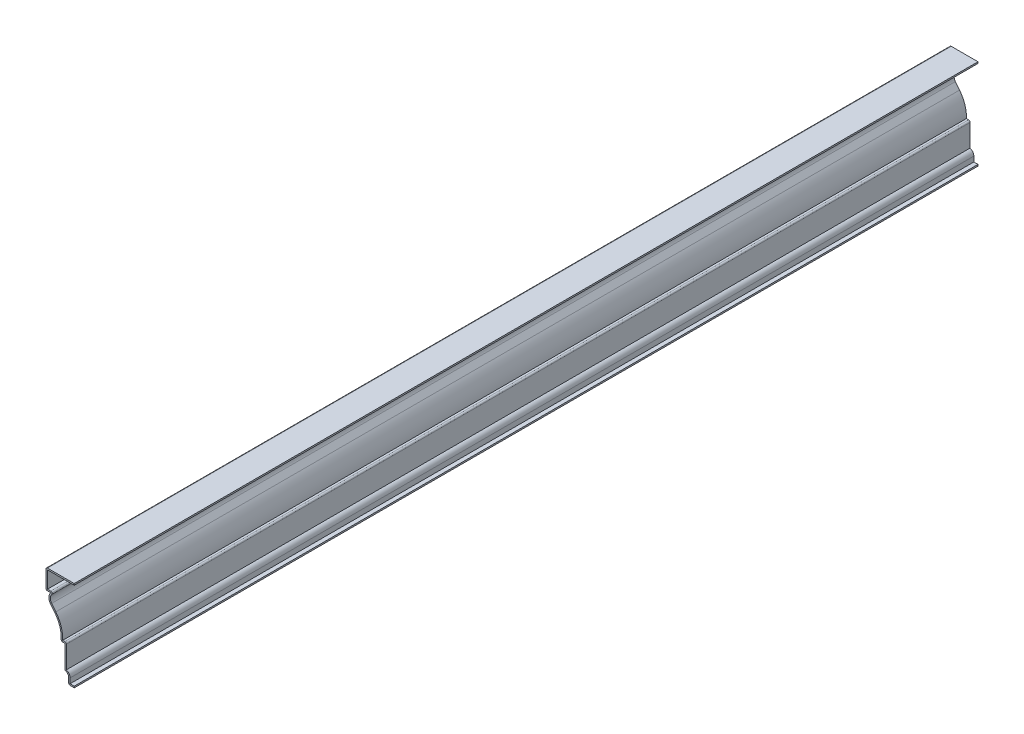
ISO-10303-21;
HEADER;
FILE_DESCRIPTION(('STEP AP214'),'2;1');
FILE_NAME('part.step','',(''),(''),'','','');
FILE_SCHEMA(('AUTOMOTIVE_DESIGN { 1 0 10303 214 1 1 1 1 }'));
ENDSEC;
DATA;
#1=APPLICATION_CONTEXT('core data for automotive mechanical design processes');
#2=APPLICATION_PROTOCOL_DEFINITION('international standard','automotive_design',2000,#1);
#3=PRODUCT_CONTEXT('',#1,'mechanical');
#4=PRODUCT('Part','Part','',(#3));
#5=PRODUCT_RELATED_PRODUCT_CATEGORY('part','',(#4));
#6=PRODUCT_DEFINITION_FORMATION('','',#4);
#7=PRODUCT_DEFINITION_CONTEXT('part definition',#1,'design');
#8=PRODUCT_DEFINITION('design','',#6,#7);
#9=PRODUCT_DEFINITION_SHAPE('','',#8);
#10=(LENGTH_UNIT() NAMED_UNIT(*) SI_UNIT(.MILLI.,.METRE.));
#11=(NAMED_UNIT(*) PLANE_ANGLE_UNIT() SI_UNIT($,.RADIAN.));
#12=(NAMED_UNIT(*) SI_UNIT($,.STERADIAN.) SOLID_ANGLE_UNIT());
#13=UNCERTAINTY_MEASURE_WITH_UNIT(LENGTH_MEASURE(1.E-05),#10,'distance_accuracy_value','');
#14=(GEOMETRIC_REPRESENTATION_CONTEXT(3) GLOBAL_UNCERTAINTY_ASSIGNED_CONTEXT((#13)) GLOBAL_UNIT_ASSIGNED_CONTEXT((#10,
#11,#12)) REPRESENTATION_CONTEXT('',''));
#15=CARTESIAN_POINT('',(0.,0.,0.));
#16=DIRECTION('',(0.,0.,1.));
#17=DIRECTION('',(1.,0.,0.));
#18=AXIS2_PLACEMENT_3D('',#15,#16,#17);
#19=CARTESIAN_POINT('',(-19.84375,60.80125,-762.));
#20=DIRECTION('',(0.,1.,0.));
#21=DIRECTION('',(-1.,0.,0.));
#22=AXIS2_PLACEMENT_3D('',#19,#20,#21);
#23=PLANE('',#22);
#24=DIRECTION('',(-1.,0.,0.));
#25=VECTOR('',#24,1.);
#26=CARTESIAN_POINT('',(-19.84375,60.80125,0.));
#27=LINE('',#26,#25);
#28=CARTESIAN_POINT('',(-19.84375,60.80125,0.));
#29=VERTEX_POINT('',#28);
#30=CARTESIAN_POINT('',(-22.5425,60.80125,0.));
#31=VERTEX_POINT('',#30);
#32=EDGE_CURVE('E323',#29,#31,#27,.T.);
#33=ORIENTED_EDGE('',*,*,#32,.F.);
#34=DIRECTION('',(0.,0.,1.));
#35=VECTOR('',#34,1.);
#36=CARTESIAN_POINT('',(-19.84375,60.80125,-762.));
#37=LINE('',#36,#35);
#38=CARTESIAN_POINT('',(-19.84375,60.80125,-762.));
#39=VERTEX_POINT('',#38);
#40=EDGE_CURVE('E261',#39,#29,#37,.T.);
#41=ORIENTED_EDGE('',*,*,#40,.F.);
#42=DIRECTION('',(-1.,0.,0.));
#43=VECTOR('',#42,1.);
#44=CARTESIAN_POINT('',(-19.84375,60.80125,-762.));
#45=LINE('',#44,#43);
#46=CARTESIAN_POINT('',(-22.5425,60.80125,-762.));
#47=VERTEX_POINT('',#46);
#48=EDGE_CURVE('E257',#39,#47,#45,.T.);
#49=ORIENTED_EDGE('',*,*,#48,.T.);
#50=DIRECTION('',(0.,0.,1.));
#51=VECTOR('',#50,1.);
#52=CARTESIAN_POINT('',(-22.5425,60.80125,-762.));
#53=LINE('',#52,#51);
#54=EDGE_CURVE('E240',#47,#31,#53,.T.);
#55=ORIENTED_EDGE('',*,*,#54,.T.);
#56=EDGE_LOOP('',(#33,#41,#49,#55));
#57=FACE_BOUND('',#56,.T.);
#58=ADVANCED_FACE('F35',(#57),#23,.T.);
#59=CARTESIAN_POINT('',(-19.84375,59.53125,-762.));
#60=DIRECTION('',(0.,0.,1.));
#61=DIRECTION('',(1.,0.,0.));
#62=AXIS2_PLACEMENT_3D('',#59,#60,#61);
#63=CYLINDRICAL_SURFACE('',#62,1.27);
#64=CARTESIAN_POINT('',(-19.84375,59.53125,0.));
#65=DIRECTION('',(0.,0.,-1.));
#66=DIRECTION('',(-1.,0.,0.));
#67=AXIS2_PLACEMENT_3D('',#64,#65,#66);
#68=CIRCLE('',#67,1.27);
#69=CARTESIAN_POINT('',(-18.8916515753779,58.6907688343383,0.));
#70=VERTEX_POINT('',#69);
#71=EDGE_CURVE('E263',#29,#70,#68,.T.);
#72=ORIENTED_EDGE('',*,*,#71,.T.);
#73=DIRECTION('',(0.,0.,1.));
#74=VECTOR('',#73,1.);
#75=CARTESIAN_POINT('',(-18.8916515753779,58.6907688343383,-762.));
#76=LINE('',#75,#74);
#77=CARTESIAN_POINT('',(-18.8916515753779,58.6907688343383,-762.));
#78=VERTEX_POINT('',#77);
#79=EDGE_CURVE('E384',#78,#70,#76,.T.);
#80=ORIENTED_EDGE('',*,*,#79,.F.);
#81=CARTESIAN_POINT('',(-19.84375,59.53125,-762.));
#82=DIRECTION('',(0.,0.,-1.));
#83=DIRECTION('',(-1.,0.,0.));
#84=AXIS2_PLACEMENT_3D('',#81,#82,#83);
#85=CIRCLE('',#84,1.27);
#86=EDGE_CURVE('E251',#39,#78,#85,.T.);
#87=ORIENTED_EDGE('',*,*,#86,.F.);
#88=ORIENTED_EDGE('',*,*,#40,.T.);
#89=EDGE_LOOP('',(#72,#80,#87,#88));
#90=FACE_BOUND('',#89,.T.);
#91=ADVANCED_FACE('F504',(#90),#63,.T.);
#92=CARTESIAN_POINT('',(-15.0832578768894,55.3288441716915,-762.));
#93=DIRECTION('',(0.,0.,1.));
#94=DIRECTION('',(1.,0.,0.));
#95=AXIS2_PLACEMENT_3D('',#92,#93,#94);
#96=CYLINDRICAL_SURFACE('',#95,5.07999999999999);
#97=CARTESIAN_POINT('',(-15.0832578768894,55.3288441716915,0.));
#98=DIRECTION('',(0.,0.,-1.));
#99=DIRECTION('',(-1.,0.,0.));
#100=AXIS2_PLACEMENT_3D('',#97,#98,#99);
#101=CIRCLE('',#100,5.07999999999999);
#102=CARTESIAN_POINT('',(-19.0558573598456,52.1626392907629,0.));
#103=VERTEX_POINT('',#102);
#104=EDGE_CURVE('E266',#103,#70,#101,.T.);
#105=ORIENTED_EDGE('',*,*,#104,.F.);
#106=DIRECTION('',(0.,0.,1.));
#107=VECTOR('',#106,1.);
#108=CARTESIAN_POINT('',(-19.0558573598456,52.1626392907629,-762.));
#109=LINE('',#108,#107);
#110=CARTESIAN_POINT('',(-19.0558573598456,52.1626392907629,-762.));
#111=VERTEX_POINT('',#110);
#112=EDGE_CURVE('E386',#111,#103,#109,.T.);
#113=ORIENTED_EDGE('',*,*,#112,.F.);
#114=CARTESIAN_POINT('',(-15.0832578768894,55.3288441716915,-762.));
#115=DIRECTION('',(0.,0.,-1.));
#116=DIRECTION('',(-1.,0.,0.));
#117=AXIS2_PLACEMENT_3D('',#114,#115,#116);
#118=CIRCLE('',#117,5.07999999999999);
#119=EDGE_CURVE('E319',#111,#78,#118,.T.);
#120=ORIENTED_EDGE('',*,*,#119,.T.);
#121=ORIENTED_EDGE('',*,*,#79,.T.);
#122=EDGE_LOOP('',(#105,#113,#120,#121));
#123=FACE_BOUND('',#122,.T.);
#124=ADVANCED_FACE('F607',(#123),#96,.F.);
#125=CARTESIAN_POINT('',(-15.529033616988,47.737575624875,-762.));
#126=DIRECTION('',(0.782007772235479,0.623268677348143,0.));
#127=DIRECTION('',(-0.623268677348143,0.782007772235479,0.));
#128=AXIS2_PLACEMENT_3D('',#125,#126,#127);
#129=PLANE('',#128);
#130=DIRECTION('',(-0.623268677348143,0.782007772235479,0.));
#131=VECTOR('',#130,1.);
#132=CARTESIAN_POINT('',(-15.529033616988,47.737575624875,0.));
#133=LINE('',#132,#131);
#134=CARTESIAN_POINT('',(-15.529033616988,47.737575624875,0.));
#135=VERTEX_POINT('',#134);
#136=EDGE_CURVE('E377',#135,#103,#133,.T.);
#137=ORIENTED_EDGE('',*,*,#136,.F.);
#138=DIRECTION('',(0.,0.,1.));
#139=VECTOR('',#138,1.);
#140=CARTESIAN_POINT('',(-15.529033616988,47.737575624875,-762.));
#141=LINE('',#140,#139);
#142=CARTESIAN_POINT('',(-15.529033616988,47.737575624875,-762.));
#143=VERTEX_POINT('',#142);
#144=EDGE_CURVE('E388',#143,#135,#141,.T.);
#145=ORIENTED_EDGE('',*,*,#144,.F.);
#146=DIRECTION('',(-0.623268677348143,0.782007772235479,0.));
#147=VECTOR('',#146,1.);
#148=CARTESIAN_POINT('',(-15.529033616988,47.737575624875,-762.));
#149=LINE('',#148,#147);
#150=EDGE_CURVE('E316',#143,#111,#149,.T.);
#151=ORIENTED_EDGE('',*,*,#150,.T.);
#152=ORIENTED_EDGE('',*,*,#112,.T.);
#153=EDGE_LOOP('',(#137,#145,#151,#152));
#154=FACE_BOUND('',#153,.T.);
#155=ADVANCED_FACE('F511',(#154),#129,.T.);
#156=CARTESIAN_POINT('',(-36.3851809025081,31.115,-762.));
#157=DIRECTION('',(0.,0.,1.));
#158=DIRECTION('',(1.,0.,0.));
#159=AXIS2_PLACEMENT_3D('',#156,#157,#158);
#160=CYLINDRICAL_SURFACE('',#159,26.67);
#161=CARTESIAN_POINT('',(-36.3851809025081,31.115,0.));
#162=DIRECTION('',(0.,0.,1.));
#163=DIRECTION('',(1.,0.,0.));
#164=AXIS2_PLACEMENT_3D('',#161,#162,#163);
#165=CIRCLE('',#164,26.67);
#166=CARTESIAN_POINT('',(-9.74543615898631,29.845,0.));
#167=VERTEX_POINT('',#166);
#168=EDGE_CURVE('E374',#167,#135,#165,.T.);
#169=ORIENTED_EDGE('',*,*,#168,.F.);
#170=DIRECTION('',(0.,0.,1.));
#171=VECTOR('',#170,1.);
#172=CARTESIAN_POINT('',(-9.74543615898631,29.845,-762.));
#173=LINE('',#172,#171);
#174=CARTESIAN_POINT('',(-9.74543615898631,29.845,-762.));
#175=VERTEX_POINT('',#174);
#176=EDGE_CURVE('E390',#175,#167,#173,.T.);
#177=ORIENTED_EDGE('',*,*,#176,.F.);
#178=CARTESIAN_POINT('',(-36.3851809025081,31.115,-762.));
#179=DIRECTION('',(0.,0.,1.));
#180=DIRECTION('',(1.,0.,0.));
#181=AXIS2_PLACEMENT_3D('',#178,#179,#180);
#182=CIRCLE('',#181,26.67);
#183=EDGE_CURVE('E313',#175,#143,#182,.T.);
#184=ORIENTED_EDGE('',*,*,#183,.T.);
#185=ORIENTED_EDGE('',*,*,#144,.T.);
#186=EDGE_LOOP('',(#169,#177,#184,#185));
#187=FACE_BOUND('',#186,.T.);
#188=ADVANCED_FACE('F514',(#187),#160,.T.);
#189=CARTESIAN_POINT('',(-6.6675,29.845,-762.));
#190=DIRECTION('',(0.,1.,0.));
#191=DIRECTION('',(0.,0.,1.));
#192=AXIS2_PLACEMENT_3D('',#189,#190,#191);
#193=PLANE('',#192);
#194=DIRECTION('',(-1.,0.,0.));
#195=VECTOR('',#194,1.);
#196=CARTESIAN_POINT('',(-6.6675,29.845,0.));
#197=LINE('',#196,#195);
#198=CARTESIAN_POINT('',(-7.9375,29.845,0.));
#199=VERTEX_POINT('',#198);
#200=EDGE_CURVE('E372',#199,#167,#197,.T.);
#201=ORIENTED_EDGE('',*,*,#200,.F.);
#202=DIRECTION('',(0.,0.,1.));
#203=VECTOR('',#202,1.);
#204=CARTESIAN_POINT('',(-7.9375,29.845,-762.));
#205=LINE('',#204,#203);
#206=CARTESIAN_POINT('',(-7.9375,29.845,-762.));
#207=VERTEX_POINT('',#206);
#208=EDGE_CURVE('E460',#199,#207,#205,.F.);
#209=ORIENTED_EDGE('',*,*,#208,.T.);
#210=DIRECTION('',(-1.,0.,0.));
#211=VECTOR('',#210,1.);
#212=CARTESIAN_POINT('',(-6.6675,29.845,-762.));
#213=LINE('',#212,#211);
#214=EDGE_CURVE('E311',#207,#175,#213,.T.);
#215=ORIENTED_EDGE('',*,*,#214,.T.);
#216=ORIENTED_EDGE('',*,*,#176,.T.);
#217=EDGE_LOOP('',(#201,#209,#215,#216));
#218=FACE_BOUND('',#217,.T.);
#219=ADVANCED_FACE('F757',(#218),#193,.T.);
#220=CARTESIAN_POINT('',(-6.6675,9.81595949713711,-762.));
#221=DIRECTION('',(1.,0.,0.));
#222=DIRECTION('',(0.,0.,-1.));
#223=AXIS2_PLACEMENT_3D('',#220,#221,#222);
#224=PLANE('',#223);
#225=DIRECTION('',(0.,1.,0.));
#226=VECTOR('',#225,1.);
#227=CARTESIAN_POINT('',(-6.6675,9.81595949713711,-762.));
#228=LINE('',#227,#226);
#229=CARTESIAN_POINT('',(-6.6675,9.81595949713711,-762.));
#230=VERTEX_POINT('',#229);
#231=CARTESIAN_POINT('',(-6.6675,28.575,-762.));
#232=VERTEX_POINT('',#231);
#233=EDGE_CURVE('E308',#230,#232,#228,.T.);
#234=ORIENTED_EDGE('',*,*,#233,.T.);
#235=DIRECTION('',(0.,0.,1.));
#236=VECTOR('',#235,1.);
#237=CARTESIAN_POINT('',(-6.6675,28.575,-762.));
#238=LINE('',#237,#236);
#239=CARTESIAN_POINT('',(-6.6675,28.575,0.));
#240=VERTEX_POINT('',#239);
#241=EDGE_CURVE('E457',#232,#240,#238,.T.);
#242=ORIENTED_EDGE('',*,*,#241,.T.);
#243=DIRECTION('',(0.,1.,0.));
#244=VECTOR('',#243,1.);
#245=CARTESIAN_POINT('',(-6.6675,9.81595949713711,0.));
#246=LINE('',#245,#244);
#247=CARTESIAN_POINT('',(-6.6675,9.81595949713711,0.));
#248=VERTEX_POINT('',#247);
#249=EDGE_CURVE('E369',#248,#240,#246,.T.);
#250=ORIENTED_EDGE('',*,*,#249,.F.);
#251=DIRECTION('',(0.,0.,1.));
#252=VECTOR('',#251,1.);
#253=CARTESIAN_POINT('',(-6.6675,9.81595949713711,-762.));
#254=LINE('',#253,#252);
#255=EDGE_CURVE('E393',#230,#248,#254,.T.);
#256=ORIENTED_EDGE('',*,*,#255,.F.);
#257=EDGE_LOOP('',(#234,#242,#250,#256));
#258=FACE_BOUND('',#257,.T.);
#259=ADVANCED_FACE('F526',(#258),#224,.T.);
#260=CARTESIAN_POINT('',(-7.9375,5.55625000000001,-762.));
#261=DIRECTION('',(0.,0.,1.));
#262=DIRECTION('',(1.,0.,0.));
#263=AXIS2_PLACEMENT_3D('',#260,#261,#262);
#264=CYLINDRICAL_SURFACE('',#263,4.445);
#265=CARTESIAN_POINT('',(-7.9375,5.55625000000001,0.));
#266=DIRECTION('',(0.,0.,1.));
#267=DIRECTION('',(1.,0.,0.));
#268=AXIS2_PLACEMENT_3D('',#265,#266,#267);
#269=CIRCLE('',#268,4.445);
#270=CARTESIAN_POINT('',(-3.4925,5.55625000000001,0.));
#271=VERTEX_POINT('',#270);
#272=EDGE_CURVE('E366',#271,#248,#269,.T.);
#273=ORIENTED_EDGE('',*,*,#272,.F.);
#274=DIRECTION('',(0.,0.,1.));
#275=VECTOR('',#274,1.);
#276=CARTESIAN_POINT('',(-3.4925,5.55625000000001,-762.));
#277=LINE('',#276,#275);
#278=CARTESIAN_POINT('',(-3.4925,5.55625000000001,-762.));
#279=VERTEX_POINT('',#278);
#280=EDGE_CURVE('E395',#279,#271,#277,.T.);
#281=ORIENTED_EDGE('',*,*,#280,.F.);
#282=CARTESIAN_POINT('',(-7.9375,5.55625000000001,-762.));
#283=DIRECTION('',(0.,0.,1.));
#284=DIRECTION('',(1.,0.,0.));
#285=AXIS2_PLACEMENT_3D('',#282,#283,#284);
#286=CIRCLE('',#285,4.445);
#287=EDGE_CURVE('E305',#279,#230,#286,.T.);
#288=ORIENTED_EDGE('',*,*,#287,.T.);
#289=ORIENTED_EDGE('',*,*,#255,.T.);
#290=EDGE_LOOP('',(#273,#281,#288,#289));
#291=FACE_BOUND('',#290,.T.);
#292=ADVANCED_FACE('F531',(#291),#264,.T.);
#293=CARTESIAN_POINT('',(-3.4925,1.27,-762.));
#294=DIRECTION('',(1.,0.,0.));
#295=DIRECTION('',(0.,0.,-1.));
#296=AXIS2_PLACEMENT_3D('',#293,#294,#295);
#297=PLANE('',#296);
#298=DIRECTION('',(0.,1.,0.));
#299=VECTOR('',#298,1.);
#300=CARTESIAN_POINT('',(-3.4925,1.27,0.));
#301=LINE('',#300,#299);
#302=CARTESIAN_POINT('',(-3.4925,1.27,0.));
#303=VERTEX_POINT('',#302);
#304=EDGE_CURVE('E363',#303,#271,#301,.T.);
#305=ORIENTED_EDGE('',*,*,#304,.F.);
#306=DIRECTION('',(0.,0.,1.));
#307=VECTOR('',#306,1.);
#308=CARTESIAN_POINT('',(-3.4925,1.27,-762.));
#309=LINE('',#308,#307);
#310=CARTESIAN_POINT('',(-3.4925,1.27,-762.));
#311=VERTEX_POINT('',#310);
#312=EDGE_CURVE('E397',#311,#303,#309,.T.);
#313=ORIENTED_EDGE('',*,*,#312,.F.);
#314=DIRECTION('',(0.,1.,0.));
#315=VECTOR('',#314,1.);
#316=CARTESIAN_POINT('',(-3.4925,1.27,-762.));
#317=LINE('',#316,#315);
#318=EDGE_CURVE('E302',#311,#279,#317,.T.);
#319=ORIENTED_EDGE('',*,*,#318,.T.);
#320=ORIENTED_EDGE('',*,*,#280,.T.);
#321=EDGE_LOOP('',(#305,#313,#319,#320));
#322=FACE_BOUND('',#321,.T.);
#323=ADVANCED_FACE('F536',(#322),#297,.T.);
#324=CARTESIAN_POINT('',(0.,1.27,-762.));
#325=DIRECTION('',(0.,1.,0.));
#326=DIRECTION('',(0.,0.,1.));
#327=AXIS2_PLACEMENT_3D('',#324,#325,#326);
#328=PLANE('',#327);
#329=DIRECTION('',(-1.,0.,0.));
#330=VECTOR('',#329,1.);
#331=CARTESIAN_POINT('',(0.,1.27,0.));
#332=LINE('',#331,#330);
#333=CARTESIAN_POINT('',(0.,1.27,0.));
#334=VERTEX_POINT('',#333);
#335=EDGE_CURVE('E360',#334,#303,#332,.T.);
#336=ORIENTED_EDGE('',*,*,#335,.F.);
#337=DIRECTION('',(0.,0.,1.));
#338=VECTOR('',#337,1.);
#339=CARTESIAN_POINT('',(0.,1.27,-762.));
#340=LINE('',#339,#338);
#341=CARTESIAN_POINT('',(0.,1.27,-762.));
#342=VERTEX_POINT('',#341);
#343=EDGE_CURVE('E399',#342,#334,#340,.T.);
#344=ORIENTED_EDGE('',*,*,#343,.F.);
#345=DIRECTION('',(-1.,0.,0.));
#346=VECTOR('',#345,1.);
#347=CARTESIAN_POINT('',(0.,1.27,-762.));
#348=LINE('',#347,#346);
#349=EDGE_CURVE('E299',#342,#311,#348,.T.);
#350=ORIENTED_EDGE('',*,*,#349,.T.);
#351=ORIENTED_EDGE('',*,*,#312,.T.);
#352=EDGE_LOOP('',(#336,#344,#350,#351));
#353=FACE_BOUND('',#352,.T.);
#354=ADVANCED_FACE('F539',(#353),#328,.T.);
#355=CARTESIAN_POINT('',(0.,1.27,-762.));
#356=DIRECTION('',(-1.,0.,0.));
#357=DIRECTION('',(0.,0.,1.));
#358=AXIS2_PLACEMENT_3D('',#355,#356,#357);
#359=PLANE('',#358);
#360=DIRECTION('',(0.,-1.,0.));
#361=VECTOR('',#360,1.);
#362=CARTESIAN_POINT('',(0.,1.27,0.));
#363=LINE('',#362,#361);
#364=CARTESIAN_POINT('',(0.,0.,0.));
#365=VERTEX_POINT('',#364);
#366=EDGE_CURVE('E358',#334,#365,#363,.T.);
#367=ORIENTED_EDGE('',*,*,#366,.T.);
#368=DIRECTION('',(0.,0.,1.));
#369=VECTOR('',#368,1.);
#370=CARTESIAN_POINT('',(0.,0.,-762.));
#371=LINE('',#370,#369);
#372=CARTESIAN_POINT('',(0.,0.,-762.));
#373=VERTEX_POINT('',#372);
#374=EDGE_CURVE('E401',#373,#365,#371,.T.);
#375=ORIENTED_EDGE('',*,*,#374,.F.);
#376=DIRECTION('',(0.,-1.,0.));
#377=VECTOR('',#376,1.);
#378=CARTESIAN_POINT('',(0.,1.27,-762.));
#379=LINE('',#378,#377);
#380=EDGE_CURVE('E297',#342,#373,#379,.T.);
#381=ORIENTED_EDGE('',*,*,#380,.F.);
#382=ORIENTED_EDGE('',*,*,#343,.T.);
#383=EDGE_LOOP('',(#367,#375,#381,#382));
#384=FACE_BOUND('',#383,.T.);
#385=ADVANCED_FACE('F545',(#384),#359,.F.);
#386=CARTESIAN_POINT('',(0.,0.,-762.));
#387=DIRECTION('',(0.,1.,0.));
#388=DIRECTION('',(-1.,0.,0.));
#389=AXIS2_PLACEMENT_3D('',#386,#387,#388);
#390=PLANE('',#389);
#391=DIRECTION('',(-1.,0.,0.));
#392=VECTOR('',#391,1.);
#393=CARTESIAN_POINT('',(0.,0.,0.));
#394=LINE('',#393,#392);
#395=CARTESIAN_POINT('',(-3.4925,0.,0.));
#396=VERTEX_POINT('',#395);
#397=EDGE_CURVE('E355',#365,#396,#394,.T.);
#398=ORIENTED_EDGE('',*,*,#397,.T.);
#399=DIRECTION('',(0.,0.,1.));
#400=VECTOR('',#399,1.);
#401=CARTESIAN_POINT('',(-3.4925,0.,-762.));
#402=LINE('',#401,#400);
#403=CARTESIAN_POINT('',(-3.4925,0.,-762.));
#404=VERTEX_POINT('',#403);
#405=EDGE_CURVE('E439',#396,#404,#402,.F.);
#406=ORIENTED_EDGE('',*,*,#405,.T.);
#407=DIRECTION('',(-1.,0.,0.));
#408=VECTOR('',#407,1.);
#409=CARTESIAN_POINT('',(0.,0.,-762.));
#410=LINE('',#409,#408);
#411=EDGE_CURVE('E295',#373,#404,#410,.T.);
#412=ORIENTED_EDGE('',*,*,#411,.F.);
#413=ORIENTED_EDGE('',*,*,#374,.T.);
#414=EDGE_LOOP('',(#398,#406,#412,#413));
#415=FACE_BOUND('',#414,.T.);
#416=ADVANCED_FACE('F549',(#415),#390,.F.);
#417=CARTESIAN_POINT('',(-4.7625,0.,-762.));
#418=DIRECTION('',(1.,0.,0.));
#419=DIRECTION('',(0.,1.,0.));
#420=AXIS2_PLACEMENT_3D('',#417,#418,#419);
#421=PLANE('',#420);
#422=DIRECTION('',(0.,1.,0.));
#423=VECTOR('',#422,1.);
#424=CARTESIAN_POINT('',(-4.7625,0.,-762.));
#425=LINE('',#424,#423);
#426=CARTESIAN_POINT('',(-4.7625,1.27,-762.));
#427=VERTEX_POINT('',#426);
#428=CARTESIAN_POINT('',(-4.7625,5.55625000000001,-762.));
#429=VERTEX_POINT('',#428);
#430=EDGE_CURVE('E293',#427,#429,#425,.T.);
#431=ORIENTED_EDGE('',*,*,#430,.F.);
#432=DIRECTION('',(0.,0.,1.));
#433=VECTOR('',#432,1.);
#434=CARTESIAN_POINT('',(-4.7625,1.27,-762.));
#435=LINE('',#434,#433);
#436=CARTESIAN_POINT('',(-4.7625,1.27,0.));
#437=VERTEX_POINT('',#436);
#438=EDGE_CURVE('E383',#427,#437,#435,.T.);
#439=ORIENTED_EDGE('',*,*,#438,.T.);
#440=DIRECTION('',(0.,1.,0.));
#441=VECTOR('',#440,1.);
#442=CARTESIAN_POINT('',(-4.7625,0.,0.));
#443=LINE('',#442,#441);
#444=CARTESIAN_POINT('',(-4.7625,5.55625000000001,0.));
#445=VERTEX_POINT('',#444);
#446=EDGE_CURVE('E353',#437,#445,#443,.T.);
#447=ORIENTED_EDGE('',*,*,#446,.T.);
#448=DIRECTION('',(0.,0.,1.));
#449=VECTOR('',#448,1.);
#450=CARTESIAN_POINT('',(-4.7625,5.55625000000001,-762.));
#451=LINE('',#450,#449);
#452=EDGE_CURVE('E404',#429,#445,#451,.T.);
#453=ORIENTED_EDGE('',*,*,#452,.F.);
#454=EDGE_LOOP('',(#431,#439,#447,#453));
#455=FACE_BOUND('',#454,.T.);
#456=ADVANCED_FACE('F557',(#455),#421,.F.);
#457=CARTESIAN_POINT('',(-7.9375,5.55625000000001,-762.));
#458=DIRECTION('',(0.,0.,1.));
#459=DIRECTION('',(1.,0.,0.));
#460=AXIS2_PLACEMENT_3D('',#457,#458,#459);
#461=CYLINDRICAL_SURFACE('',#460,3.175);
#462=CARTESIAN_POINT('',(-7.9375,5.55625000000001,0.));
#463=DIRECTION('',(0.,0.,1.));
#464=DIRECTION('',(1.,0.,0.));
#465=AXIS2_PLACEMENT_3D('',#462,#463,#464);
#466=CIRCLE('',#465,3.175);
#467=CARTESIAN_POINT('',(-7.03035714285714,8.59889964081222,0.));
#468=VERTEX_POINT('',#467);
#469=EDGE_CURVE('E350',#445,#468,#466,.T.);
#470=ORIENTED_EDGE('',*,*,#469,.T.);
#471=DIRECTION('',(0.,0.,1.));
#472=VECTOR('',#471,1.);
#473=CARTESIAN_POINT('',(-7.03035714285714,8.59889964081222,-762.));
#474=LINE('',#473,#472);
#475=CARTESIAN_POINT('',(-7.03035714285714,8.59889964081222,-762.));
#476=VERTEX_POINT('',#475);
#477=EDGE_CURVE('E455',#468,#476,#474,.F.);
#478=ORIENTED_EDGE('',*,*,#477,.T.);
#479=CARTESIAN_POINT('',(-7.9375,5.55625000000001,-762.));
#480=DIRECTION('',(0.,0.,1.));
#481=DIRECTION('',(1.,0.,0.));
#482=AXIS2_PLACEMENT_3D('',#479,#480,#481);
#483=CIRCLE('',#482,3.175);
#484=EDGE_CURVE('E290',#429,#476,#483,.T.);
#485=ORIENTED_EDGE('',*,*,#484,.F.);
#486=ORIENTED_EDGE('',*,*,#452,.T.);
#487=EDGE_LOOP('',(#470,#478,#485,#486));
#488=FACE_BOUND('',#487,.T.);
#489=ADVANCED_FACE('F561',(#488),#461,.F.);
#490=CARTESIAN_POINT('',(-7.9375,8.73125000000001,-762.));
#491=DIRECTION('',(1.,0.,0.));
#492=DIRECTION('',(0.,0.,-1.));
#493=AXIS2_PLACEMENT_3D('',#490,#491,#492);
#494=PLANE('',#493);
#495=DIRECTION('',(0.,1.,0.));
#496=VECTOR('',#495,1.);
#497=CARTESIAN_POINT('',(-7.9375,8.73125000000001,-762.));
#498=LINE('',#497,#496);
#499=CARTESIAN_POINT('',(-7.9375,9.81595949713711,-762.));
#500=VERTEX_POINT('',#499);
#501=CARTESIAN_POINT('',(-7.9375,28.575,-762.));
#502=VERTEX_POINT('',#501);
#503=EDGE_CURVE('E288',#500,#502,#498,.T.);
#504=ORIENTED_EDGE('',*,*,#503,.F.);
#505=DIRECTION('',(0.,0.,1.));
#506=VECTOR('',#505,1.);
#507=CARTESIAN_POINT('',(-7.9375,9.81595949713711,-762.));
#508=LINE('',#507,#506);
#509=CARTESIAN_POINT('',(-7.9375,9.81595949713711,0.));
#510=VERTEX_POINT('',#509);
#511=EDGE_CURVE('E452',#500,#510,#508,.T.);
#512=ORIENTED_EDGE('',*,*,#511,.T.);
#513=DIRECTION('',(0.,1.,0.));
#514=VECTOR('',#513,1.);
#515=CARTESIAN_POINT('',(-7.9375,8.73125000000001,0.));
#516=LINE('',#515,#514);
#517=CARTESIAN_POINT('',(-7.9375,28.575,0.));
#518=VERTEX_POINT('',#517);
#519=EDGE_CURVE('E348',#510,#518,#516,.T.);
#520=ORIENTED_EDGE('',*,*,#519,.T.);
#521=DIRECTION('',(0.,0.,1.));
#522=VECTOR('',#521,1.);
#523=CARTESIAN_POINT('',(-7.9375,28.575,-762.));
#524=LINE('',#523,#522);
#525=EDGE_CURVE('E407',#502,#518,#524,.T.);
#526=ORIENTED_EDGE('',*,*,#525,.F.);
#527=EDGE_LOOP('',(#504,#512,#520,#526));
#528=FACE_BOUND('',#527,.T.);
#529=ADVANCED_FACE('F570',(#528),#494,.F.);
#530=CARTESIAN_POINT('',(-7.9375,28.575,-762.));
#531=DIRECTION('',(0.,1.,0.));
#532=DIRECTION('',(0.,0.,1.));
#533=AXIS2_PLACEMENT_3D('',#530,#531,#532);
#534=PLANE('',#533);
#535=DIRECTION('',(-1.,0.,0.));
#536=VECTOR('',#535,1.);
#537=CARTESIAN_POINT('',(-7.9375,28.575,0.));
#538=LINE('',#537,#536);
#539=CARTESIAN_POINT('',(-9.74543615898631,28.575,0.));
#540=VERTEX_POINT('',#539);
#541=EDGE_CURVE('E345',#518,#540,#538,.T.);
#542=ORIENTED_EDGE('',*,*,#541,.T.);
#543=DIRECTION('',(0.,0.,1.));
#544=VECTOR('',#543,1.);
#545=CARTESIAN_POINT('',(-9.74543615898631,28.575,-762.));
#546=LINE('',#545,#544);
#547=CARTESIAN_POINT('',(-9.74543615898631,28.575,-762.));
#548=VERTEX_POINT('',#547);
#549=EDGE_CURVE('E465',#540,#548,#546,.F.);
#550=ORIENTED_EDGE('',*,*,#549,.T.);
#551=DIRECTION('',(-1.,0.,0.));
#552=VECTOR('',#551,1.);
#553=CARTESIAN_POINT('',(-7.9375,28.575,-762.));
#554=LINE('',#553,#552);
#555=EDGE_CURVE('E285',#502,#548,#554,.T.);
#556=ORIENTED_EDGE('',*,*,#555,.F.);
#557=ORIENTED_EDGE('',*,*,#525,.T.);
#558=EDGE_LOOP('',(#542,#550,#556,#557));
#559=FACE_BOUND('',#558,.T.);
#560=ADVANCED_FACE('F576',(#559),#534,.F.);
#561=CARTESIAN_POINT('',(-36.3851809025081,31.115,-762.));
#562=DIRECTION('',(0.,0.,1.));
#563=DIRECTION('',(1.,0.,0.));
#564=AXIS2_PLACEMENT_3D('',#561,#562,#563);
#565=CYLINDRICAL_SURFACE('',#564,25.4);
#566=CARTESIAN_POINT('',(-36.3851809025081,31.115,-762.));
#567=DIRECTION('',(0.,0.,1.));
#568=DIRECTION('',(1.,0.,0.));
#569=AXIS2_PLACEMENT_3D('',#566,#567,#568);
#570=CIRCLE('',#569,25.4);
#571=CARTESIAN_POINT('',(-11.0139954324873,29.9054761904762,-762.));
#572=VERTEX_POINT('',#571);
#573=CARTESIAN_POINT('',(-16.522183487727,46.9460244046429,-762.));
#574=VERTEX_POINT('',#573);
#575=EDGE_CURVE('E283',#572,#574,#570,.T.);
#576=ORIENTED_EDGE('',*,*,#575,.F.);
#577=DIRECTION('',(0.,0.,1.));
#578=VECTOR('',#577,1.);
#579=CARTESIAN_POINT('',(-11.0139954324873,29.9054761904762,-762.));
#580=LINE('',#579,#578);
#581=CARTESIAN_POINT('',(-11.0139954324873,29.9054761904762,0.));
#582=VERTEX_POINT('',#581);
#583=EDGE_CURVE('E462',#572,#582,#580,.T.);
#584=ORIENTED_EDGE('',*,*,#583,.T.);
#585=CARTESIAN_POINT('',(-36.3851809025081,31.115,0.));
#586=DIRECTION('',(0.,0.,1.));
#587=DIRECTION('',(1.,0.,0.));
#588=AXIS2_PLACEMENT_3D('',#585,#586,#587);
#589=CIRCLE('',#588,25.4);
#590=CARTESIAN_POINT('',(-16.522183487727,46.9460244046429,0.));
#591=VERTEX_POINT('',#590);
#592=EDGE_CURVE('E343',#582,#591,#589,.T.);
#593=ORIENTED_EDGE('',*,*,#592,.T.);
#594=DIRECTION('',(0.,0.,1.));
#595=VECTOR('',#594,1.);
#596=CARTESIAN_POINT('',(-16.522183487727,46.9460244046429,-762.));
#597=LINE('',#596,#595);
#598=EDGE_CURVE('E410',#574,#591,#597,.T.);
#599=ORIENTED_EDGE('',*,*,#598,.F.);
#600=EDGE_LOOP('',(#576,#584,#593,#599));
#601=FACE_BOUND('',#600,.T.);
#602=ADVANCED_FACE('F585',(#601),#565,.F.);
#603=CARTESIAN_POINT('',(-16.522183487727,46.9460244046429,-762.));
#604=DIRECTION('',(0.782007772235479,0.623268677348142,0.));
#605=DIRECTION('',(-0.623268677348142,0.782007772235479,0.));
#606=AXIS2_PLACEMENT_3D('',#603,#604,#605);
#607=PLANE('',#606);
#608=DIRECTION('',(-0.623268677348142,0.78200777223548,0.));
#609=VECTOR('',#608,1.);
#610=CARTESIAN_POINT('',(-16.522183487727,46.9460244046429,0.));
#611=LINE('',#610,#609);
#612=CARTESIAN_POINT('',(-20.0490072305846,51.3710880705308,0.));
#613=VERTEX_POINT('',#612);
#614=EDGE_CURVE('E341',#591,#613,#611,.T.);
#615=ORIENTED_EDGE('',*,*,#614,.T.);
#616=DIRECTION('',(0.,0.,1.));
#617=VECTOR('',#616,1.);
#618=CARTESIAN_POINT('',(-20.0490072305846,51.3710880705308,-762.));
#619=LINE('',#618,#617);
#620=CARTESIAN_POINT('',(-20.0490072305846,51.3710880705308,-762.));
#621=VERTEX_POINT('',#620);
#622=EDGE_CURVE('E413',#621,#613,#619,.T.);
#623=ORIENTED_EDGE('',*,*,#622,.F.);
#624=DIRECTION('',(-0.623268677348142,0.78200777223548,0.));
#625=VECTOR('',#624,1.);
#626=CARTESIAN_POINT('',(-16.522183487727,46.9460244046429,-762.));
#627=LINE('',#626,#625);
#628=EDGE_CURVE('E281',#574,#621,#627,.T.);
#629=ORIENTED_EDGE('',*,*,#628,.F.);
#630=ORIENTED_EDGE('',*,*,#598,.T.);
#631=EDGE_LOOP('',(#615,#623,#629,#630));
#632=FACE_BOUND('',#631,.T.);
#633=ADVANCED_FACE('F590',(#632),#607,.F.);
#634=CARTESIAN_POINT('',(-15.0832578768894,55.3288441716915,-762.));
#635=DIRECTION('',(0.,0.,1.));
#636=DIRECTION('',(1.,0.,0.));
#637=AXIS2_PLACEMENT_3D('',#634,#635,#636);
#638=CYLINDRICAL_SURFACE('',#637,6.34999999999999);
#639=CARTESIAN_POINT('',(-15.0832578768894,55.3288441716915,0.));
#640=DIRECTION('',(0.,0.,-1.));
#641=DIRECTION('',(-1.,0.,0.));
#642=AXIS2_PLACEMENT_3D('',#639,#640,#641);
#643=CIRCLE('',#642,6.34999999999999);
#644=CARTESIAN_POINT('',(-19.84375,59.53125,0.));
#645=VERTEX_POINT('',#644);
#646=EDGE_CURVE('E339',#613,#645,#643,.T.);
#647=ORIENTED_EDGE('',*,*,#646,.T.);
#648=DIRECTION('',(0.,0.,1.));
#649=VECTOR('',#648,1.);
#650=CARTESIAN_POINT('',(-19.84375,59.53125,-762.));
#651=LINE('',#650,#649);
#652=CARTESIAN_POINT('',(-19.84375,59.53125,-762.));
#653=VERTEX_POINT('',#652);
#654=EDGE_CURVE('E416',#653,#645,#651,.T.);
#655=ORIENTED_EDGE('',*,*,#654,.F.);
#656=CARTESIAN_POINT('',(-15.0832578768894,55.3288441716915,-762.));
#657=DIRECTION('',(0.,0.,-1.));
#658=DIRECTION('',(-1.,0.,0.));
#659=AXIS2_PLACEMENT_3D('',#656,#657,#658);
#660=CIRCLE('',#659,6.34999999999999);
#661=EDGE_CURVE('E279',#621,#653,#660,.T.);
#662=ORIENTED_EDGE('',*,*,#661,.F.);
#663=ORIENTED_EDGE('',*,*,#622,.T.);
#664=EDGE_LOOP('',(#647,#655,#662,#663));
#665=FACE_BOUND('',#664,.T.);
#666=ADVANCED_FACE('F593',(#665),#638,.T.);
#667=CARTESIAN_POINT('',(-19.84375,59.53125,-762.));
#668=DIRECTION('',(0.,1.,0.));
#669=DIRECTION('',(-1.,0.,0.));
#670=AXIS2_PLACEMENT_3D('',#667,#668,#669);
#671=PLANE('',#670);
#672=DIRECTION('',(-1.,0.,0.));
#673=VECTOR('',#672,1.);
#674=CARTESIAN_POINT('',(-19.84375,59.53125,0.));
#675=LINE('',#674,#673);
#676=CARTESIAN_POINT('',(-22.5425,59.53125,0.));
#677=VERTEX_POINT('',#676);
#678=EDGE_CURVE('E336',#645,#677,#675,.T.);
#679=ORIENTED_EDGE('',*,*,#678,.T.);
#680=DIRECTION('',(0.,0.,1.));
#681=VECTOR('',#680,1.);
#682=CARTESIAN_POINT('',(-22.5425,59.53125,-762.));
#683=LINE('',#682,#681);
#684=CARTESIAN_POINT('',(-22.5425,59.53125,-762.));
#685=VERTEX_POINT('',#684);
#686=EDGE_CURVE('E43',#677,#685,#683,.F.);
#687=ORIENTED_EDGE('',*,*,#686,.T.);
#688=DIRECTION('',(-1.,0.,0.));
#689=VECTOR('',#688,1.);
#690=CARTESIAN_POINT('',(-19.84375,59.53125,-762.));
#691=LINE('',#690,#689);
#692=EDGE_CURVE('E276',#653,#685,#691,.T.);
#693=ORIENTED_EDGE('',*,*,#692,.F.);
#694=ORIENTED_EDGE('',*,*,#654,.T.);
#695=EDGE_LOOP('',(#679,#687,#693,#694));
#696=FACE_BOUND('',#695,.T.);
#697=ADVANCED_FACE('F473',(#696),#671,.F.);
#698=CARTESIAN_POINT('',(-23.8125,59.53125,-762.));
#699=DIRECTION('',(1.,0.,0.));
#700=DIRECTION('',(0.,0.,-1.));
#701=AXIS2_PLACEMENT_3D('',#698,#699,#700);
#702=PLANE('',#701);
#703=DIRECTION('',(0.,1.,0.));
#704=VECTOR('',#703,1.);
#705=CARTESIAN_POINT('',(-23.8125,59.53125,-762.));
#706=LINE('',#705,#704);
#707=CARTESIAN_POINT('',(-23.8125,60.80125,-762.));
#708=VERTEX_POINT('',#707);
#709=CARTESIAN_POINT('',(-23.8125,74.93,-762.));
#710=VERTEX_POINT('',#709);
#711=EDGE_CURVE('E274',#708,#710,#706,.T.);
#712=ORIENTED_EDGE('',*,*,#711,.F.);
#713=DIRECTION('',(0.,0.,1.));
#714=VECTOR('',#713,1.);
#715=CARTESIAN_POINT('',(-23.8125,60.80125,-762.));
#716=LINE('',#715,#714);
#717=CARTESIAN_POINT('',(-23.8125,60.80125,0.));
#718=VERTEX_POINT('',#717);
#719=EDGE_CURVE('E468',#708,#718,#716,.T.);
#720=ORIENTED_EDGE('',*,*,#719,.T.);
#721=DIRECTION('',(0.,1.,0.));
#722=VECTOR('',#721,1.);
#723=CARTESIAN_POINT('',(-23.8125,59.53125,0.));
#724=LINE('',#723,#722);
#725=CARTESIAN_POINT('',(-23.8125,74.93,0.));
#726=VERTEX_POINT('',#725);
#727=EDGE_CURVE('E334',#718,#726,#724,.T.);
#728=ORIENTED_EDGE('',*,*,#727,.T.);
#729=DIRECTION('',(0.,0.,1.));
#730=VECTOR('',#729,1.);
#731=CARTESIAN_POINT('',(-23.8125,74.93,-762.));
#732=LINE('',#731,#730);
#733=EDGE_CURVE('E58',#726,#710,#732,.F.);
#734=ORIENTED_EDGE('',*,*,#733,.T.);
#735=EDGE_LOOP('',(#712,#720,#728,#734));
#736=FACE_BOUND('',#735,.T.);
#737=ADVANCED_FACE('F482',(#736),#702,.F.);
#738=CARTESIAN_POINT('',(-23.8125,76.2,-762.));
#739=DIRECTION('',(0.,-1.,0.));
#740=DIRECTION('',(0.,0.,-1.));
#741=AXIS2_PLACEMENT_3D('',#738,#739,#740);
#742=PLANE('',#741);
#743=DIRECTION('',(1.,0.,0.));
#744=VECTOR('',#743,1.);
#745=CARTESIAN_POINT('',(-23.8125,76.2,-762.));
#746=LINE('',#745,#744);
#747=CARTESIAN_POINT('',(-22.5425,76.2,-762.));
#748=VERTEX_POINT('',#747);
#749=CARTESIAN_POINT('',(0.,76.2,-762.));
#750=VERTEX_POINT('',#749);
#751=EDGE_CURVE('E272',#748,#750,#746,.T.);
#752=ORIENTED_EDGE('',*,*,#751,.F.);
#753=DIRECTION('',(0.,0.,1.));
#754=VECTOR('',#753,1.);
#755=CARTESIAN_POINT('',(-22.5425,76.2,-762.));
#756=LINE('',#755,#754);
#757=CARTESIAN_POINT('',(-22.5425,76.2,0.));
#758=VERTEX_POINT('',#757);
#759=EDGE_CURVE('E11',#748,#758,#756,.T.);
#760=ORIENTED_EDGE('',*,*,#759,.T.);
#761=DIRECTION('',(1.,0.,0.));
#762=VECTOR('',#761,1.);
#763=CARTESIAN_POINT('',(-23.8125,76.2,0.));
#764=LINE('',#763,#762);
#765=CARTESIAN_POINT('',(0.,76.2,0.));
#766=VERTEX_POINT('',#765);
#767=EDGE_CURVE('E332',#758,#766,#764,.T.);
#768=ORIENTED_EDGE('',*,*,#767,.T.);
#769=DIRECTION('',(0.,0.,1.));
#770=VECTOR('',#769,1.);
#771=CARTESIAN_POINT('',(0.,76.2,-762.));
#772=LINE('',#771,#770);
#773=EDGE_CURVE('E419',#750,#766,#772,.T.);
#774=ORIENTED_EDGE('',*,*,#773,.F.);
#775=EDGE_LOOP('',(#752,#760,#768,#774));
#776=FACE_BOUND('',#775,.T.);
#777=ADVANCED_FACE('F491',(#776),#742,.F.);
#778=CARTESIAN_POINT('',(0.,76.2,-762.));
#779=DIRECTION('',(-1.,0.,0.));
#780=DIRECTION('',(0.,0.,1.));
#781=AXIS2_PLACEMENT_3D('',#778,#779,#780);
#782=PLANE('',#781);
#783=DIRECTION('',(0.,-1.,0.));
#784=VECTOR('',#783,1.);
#785=CARTESIAN_POINT('',(0.,76.2,0.));
#786=LINE('',#785,#784);
#787=CARTESIAN_POINT('',(0.,74.93,0.));
#788=VERTEX_POINT('',#787);
#789=EDGE_CURVE('E329',#766,#788,#786,.T.);
#790=ORIENTED_EDGE('',*,*,#789,.T.);
#791=DIRECTION('',(0.,0.,1.));
#792=VECTOR('',#791,1.);
#793=CARTESIAN_POINT('',(0.,74.93,-762.));
#794=LINE('',#793,#792);
#795=CARTESIAN_POINT('',(0.,74.93,-762.));
#796=VERTEX_POINT('',#795);
#797=EDGE_CURVE('E422',#796,#788,#794,.T.);
#798=ORIENTED_EDGE('',*,*,#797,.F.);
#799=DIRECTION('',(0.,-1.,0.));
#800=VECTOR('',#799,1.);
#801=CARTESIAN_POINT('',(0.,76.2,-762.));
#802=LINE('',#801,#800);
#803=EDGE_CURVE('E270',#750,#796,#802,.T.);
#804=ORIENTED_EDGE('',*,*,#803,.F.);
#805=ORIENTED_EDGE('',*,*,#773,.T.);
#806=EDGE_LOOP('',(#790,#798,#804,#805));
#807=FACE_BOUND('',#806,.T.);
#808=ADVANCED_FACE('F496',(#807),#782,.F.);
#809=CARTESIAN_POINT('',(-22.5425,74.93,-762.));
#810=DIRECTION('',(0.,-1.,0.));
#811=DIRECTION('',(0.,0.,-1.));
#812=AXIS2_PLACEMENT_3D('',#809,#810,#811);
#813=PLANE('',#812);
#814=DIRECTION('',(1.,0.,0.));
#815=VECTOR('',#814,1.);
#816=CARTESIAN_POINT('',(-22.5425,74.93,0.));
#817=LINE('',#816,#815);
#818=CARTESIAN_POINT('',(-22.5425,74.93,0.));
#819=VERTEX_POINT('',#818);
#820=EDGE_CURVE('E326',#819,#788,#817,.T.);
#821=ORIENTED_EDGE('',*,*,#820,.F.);
#822=DIRECTION('',(0.,0.,1.));
#823=VECTOR('',#822,1.);
#824=CARTESIAN_POINT('',(-22.5425,74.93,-762.));
#825=LINE('',#824,#823);
#826=CARTESIAN_POINT('',(-22.5425,74.93,-762.));
#827=VERTEX_POINT('',#826);
#828=EDGE_CURVE('E250',#827,#819,#825,.T.);
#829=ORIENTED_EDGE('',*,*,#828,.F.);
#830=DIRECTION('',(1.,0.,0.));
#831=VECTOR('',#830,1.);
#832=CARTESIAN_POINT('',(-22.5425,74.93,-762.));
#833=LINE('',#832,#831);
#834=EDGE_CURVE('E259',#827,#796,#833,.T.);
#835=ORIENTED_EDGE('',*,*,#834,.T.);
#836=ORIENTED_EDGE('',*,*,#797,.T.);
#837=EDGE_LOOP('',(#821,#829,#835,#836));
#838=FACE_BOUND('',#837,.T.);
#839=ADVANCED_FACE('F499',(#838),#813,.T.);
#840=CARTESIAN_POINT('',(-22.5425,60.80125,-762.));
#841=DIRECTION('',(1.,0.,0.));
#842=DIRECTION('',(0.,0.,-1.));
#843=AXIS2_PLACEMENT_3D('',#840,#841,#842);
#844=PLANE('',#843);
#845=DIRECTION('',(0.,1.,0.));
#846=VECTOR('',#845,1.);
#847=CARTESIAN_POINT('',(-22.5425,60.80125,0.));
#848=LINE('',#847,#846);
#849=EDGE_CURVE('E245',#31,#819,#848,.T.);
#850=ORIENTED_EDGE('',*,*,#849,.F.);
#851=ORIENTED_EDGE('',*,*,#54,.F.);
#852=DIRECTION('',(0.,1.,0.));
#853=VECTOR('',#852,1.);
#854=CARTESIAN_POINT('',(-22.5425,60.80125,-762.));
#855=LINE('',#854,#853);
#856=EDGE_CURVE('E243',#47,#827,#855,.T.);
#857=ORIENTED_EDGE('',*,*,#856,.T.);
#858=ORIENTED_EDGE('',*,*,#828,.T.);
#859=EDGE_LOOP('',(#850,#851,#857,#858));
#860=FACE_BOUND('',#859,.T.);
#861=ADVANCED_FACE('F242',(#860),#844,.T.);
#862=CARTESIAN_POINT('',(-15.0832578768894,55.3288441716915,-762.));
#863=DIRECTION('',(0.,0.,-1.));
#864=DIRECTION('',(-1.,0.,0.));
#865=AXIS2_PLACEMENT_3D('',#862,#863,#864);
#866=PLANE('',#865);
#867=ORIENTED_EDGE('',*,*,#411,.T.);
#868=CARTESIAN_POINT('',(-3.4925,1.27,-762.));
#869=DIRECTION('',(0.,0.,-1.));
#870=DIRECTION('',(-1.,0.,0.));
#871=AXIS2_PLACEMENT_3D('',#868,#869,#870);
#872=CIRCLE('',#871,1.27);
#873=EDGE_CURVE('E450',#404,#427,#872,.T.);
#874=ORIENTED_EDGE('',*,*,#873,.T.);
#875=ORIENTED_EDGE('',*,*,#430,.T.);
#876=ORIENTED_EDGE('',*,*,#484,.T.);
#877=CARTESIAN_POINT('',(-6.6675,9.81595949713711,-762.));
#878=DIRECTION('',(0.,0.,-1.));
#879=DIRECTION('',(-1.,0.,0.));
#880=AXIS2_PLACEMENT_3D('',#877,#878,#879);
#881=CIRCLE('',#880,1.27);
#882=EDGE_CURVE('E448',#476,#500,#881,.T.);
#883=ORIENTED_EDGE('',*,*,#882,.T.);
#884=ORIENTED_EDGE('',*,*,#503,.T.);
#885=ORIENTED_EDGE('',*,*,#555,.T.);
#886=CARTESIAN_POINT('',(-9.74543615898631,29.845,-762.));
#887=DIRECTION('',(0.,0.,-1.));
#888=DIRECTION('',(-1.,0.,0.));
#889=AXIS2_PLACEMENT_3D('',#886,#887,#888);
#890=CIRCLE('',#889,1.27);
#891=EDGE_CURVE('E444',#548,#572,#890,.T.);
#892=ORIENTED_EDGE('',*,*,#891,.T.);
#893=ORIENTED_EDGE('',*,*,#575,.T.);
#894=ORIENTED_EDGE('',*,*,#628,.T.);
#895=ORIENTED_EDGE('',*,*,#661,.T.);
#896=ORIENTED_EDGE('',*,*,#692,.T.);
#897=CARTESIAN_POINT('',(-22.5425,60.80125,-762.));
#898=DIRECTION('',(0.,0.,-1.));
#899=DIRECTION('',(-1.,0.,0.));
#900=AXIS2_PLACEMENT_3D('',#897,#898,#899);
#901=CIRCLE('',#900,1.27);
#902=EDGE_CURVE('E442',#685,#708,#901,.T.);
#903=ORIENTED_EDGE('',*,*,#902,.T.);
#904=ORIENTED_EDGE('',*,*,#711,.T.);
#905=CARTESIAN_POINT('',(-22.5425,74.93,-762.));
#906=DIRECTION('',(0.,0.,-1.));
#907=DIRECTION('',(-1.,0.,0.));
#908=AXIS2_PLACEMENT_3D('',#905,#906,#907);
#909=CIRCLE('',#908,1.27);
#910=EDGE_CURVE('E50',#710,#748,#909,.T.);
#911=ORIENTED_EDGE('',*,*,#910,.T.);
#912=ORIENTED_EDGE('',*,*,#751,.T.);
#913=ORIENTED_EDGE('',*,*,#803,.T.);
#914=ORIENTED_EDGE('',*,*,#834,.F.);
#915=ORIENTED_EDGE('',*,*,#856,.F.);
#916=ORIENTED_EDGE('',*,*,#48,.F.);
#917=ORIENTED_EDGE('',*,*,#86,.T.);
#918=ORIENTED_EDGE('',*,*,#119,.F.);
#919=ORIENTED_EDGE('',*,*,#150,.F.);
#920=ORIENTED_EDGE('',*,*,#183,.F.);
#921=ORIENTED_EDGE('',*,*,#214,.F.);
#922=CARTESIAN_POINT('',(-7.9375,28.575,-762.));
#923=DIRECTION('',(0.,0.,-1.));
#924=DIRECTION('',(-1.,0.,0.));
#925=AXIS2_PLACEMENT_3D('',#922,#923,#924);
#926=CIRCLE('',#925,1.27);
#927=EDGE_CURVE('E446',#207,#232,#926,.T.);
#928=ORIENTED_EDGE('',*,*,#927,.T.);
#929=ORIENTED_EDGE('',*,*,#233,.F.);
#930=ORIENTED_EDGE('',*,*,#287,.F.);
#931=ORIENTED_EDGE('',*,*,#318,.F.);
#932=ORIENTED_EDGE('',*,*,#349,.F.);
#933=ORIENTED_EDGE('',*,*,#380,.T.);
#934=EDGE_LOOP('',(#867,#874,#875,#876,#883,#884,#885,#892,#893,#894,#895,#896,#903,#904,#911,
#912,#913,#914,#915,#916,#917,#918,#919,#920,#921,#928,#929,#930,#931,#932,#933));
#935=FACE_BOUND('',#934,.T.);
#936=ADVANCED_FACE('F256',(#935),#866,.T.);
#937=CARTESIAN_POINT('',(-15.0832578768894,55.3288441716915,0.));
#938=DIRECTION('',(0.,0.,-1.));
#939=DIRECTION('',(-1.,0.,0.));
#940=AXIS2_PLACEMENT_3D('',#937,#938,#939);
#941=PLANE('',#940);
#942=ORIENTED_EDGE('',*,*,#446,.F.);
#943=CARTESIAN_POINT('',(-3.4925,1.27,0.));
#944=DIRECTION('',(0.,0.,-1.));
#945=DIRECTION('',(-1.,0.,0.));
#946=AXIS2_PLACEMENT_3D('',#943,#944,#945);
#947=CIRCLE('',#946,1.27);
#948=EDGE_CURVE('E437',#437,#396,#947,.F.);
#949=ORIENTED_EDGE('',*,*,#948,.T.);
#950=ORIENTED_EDGE('',*,*,#397,.F.);
#951=ORIENTED_EDGE('',*,*,#366,.F.);
#952=ORIENTED_EDGE('',*,*,#335,.T.);
#953=ORIENTED_EDGE('',*,*,#304,.T.);
#954=ORIENTED_EDGE('',*,*,#272,.T.);
#955=ORIENTED_EDGE('',*,*,#249,.T.);
#956=CARTESIAN_POINT('',(-7.9375,28.575,0.));
#957=DIRECTION('',(0.,0.,-1.));
#958=DIRECTION('',(-1.,0.,0.));
#959=AXIS2_PLACEMENT_3D('',#956,#957,#958);
#960=CIRCLE('',#959,1.27);
#961=EDGE_CURVE('E433',#240,#199,#960,.F.);
#962=ORIENTED_EDGE('',*,*,#961,.T.);
#963=ORIENTED_EDGE('',*,*,#200,.T.);
#964=ORIENTED_EDGE('',*,*,#168,.T.);
#965=ORIENTED_EDGE('',*,*,#136,.T.);
#966=ORIENTED_EDGE('',*,*,#104,.T.);
#967=ORIENTED_EDGE('',*,*,#71,.F.);
#968=ORIENTED_EDGE('',*,*,#32,.T.);
#969=ORIENTED_EDGE('',*,*,#849,.T.);
#970=ORIENTED_EDGE('',*,*,#820,.T.);
#971=ORIENTED_EDGE('',*,*,#789,.F.);
#972=ORIENTED_EDGE('',*,*,#767,.F.);
#973=CARTESIAN_POINT('',(-22.5425,74.93,0.));
#974=DIRECTION('',(0.,0.,-1.));
#975=DIRECTION('',(-1.,0.,0.));
#976=AXIS2_PLACEMENT_3D('',#973,#974,#975);
#977=CIRCLE('',#976,1.27);
#978=EDGE_CURVE('E427',#758,#726,#977,.F.);
#979=ORIENTED_EDGE('',*,*,#978,.T.);
#980=ORIENTED_EDGE('',*,*,#727,.F.);
#981=CARTESIAN_POINT('',(-22.5425,60.80125,0.));
#982=DIRECTION('',(0.,0.,-1.));
#983=DIRECTION('',(-1.,0.,0.));
#984=AXIS2_PLACEMENT_3D('',#981,#982,#983);
#985=CIRCLE('',#984,1.27);
#986=EDGE_CURVE('E429',#718,#677,#985,.F.);
#987=ORIENTED_EDGE('',*,*,#986,.T.);
#988=ORIENTED_EDGE('',*,*,#678,.F.);
#989=ORIENTED_EDGE('',*,*,#646,.F.);
#990=ORIENTED_EDGE('',*,*,#614,.F.);
#991=ORIENTED_EDGE('',*,*,#592,.F.);
#992=CARTESIAN_POINT('',(-9.74543615898631,29.845,0.));
#993=DIRECTION('',(0.,0.,-1.));
#994=DIRECTION('',(-1.,0.,0.));
#995=AXIS2_PLACEMENT_3D('',#992,#993,#994);
#996=CIRCLE('',#995,1.27);
#997=EDGE_CURVE('E431',#582,#540,#996,.F.);
#998=ORIENTED_EDGE('',*,*,#997,.T.);
#999=ORIENTED_EDGE('',*,*,#541,.F.);
#1000=ORIENTED_EDGE('',*,*,#519,.F.);
#1001=CARTESIAN_POINT('',(-6.6675,9.81595949713711,0.));
#1002=DIRECTION('',(0.,0.,-1.));
#1003=DIRECTION('',(-1.,0.,0.));
#1004=AXIS2_PLACEMENT_3D('',#1001,#1002,#1003);
#1005=CIRCLE('',#1004,1.27);
#1006=EDGE_CURVE('E435',#510,#468,#1005,.F.);
#1007=ORIENTED_EDGE('',*,*,#1006,.T.);
#1008=ORIENTED_EDGE('',*,*,#469,.F.);
#1009=EDGE_LOOP('',(#942,#949,#950,#951,#952,#953,#954,#955,#962,#963,#964,#965,#966,#967,#968,
#969,#970,#971,#972,#979,#980,#987,#988,#989,#990,#991,#998,#999,#1000,#1007,#1008));
#1010=FACE_BOUND('',#1009,.T.);
#1011=ADVANCED_FACE('F485',(#1010),#941,.F.);
#1012=CARTESIAN_POINT('',(-3.4925,1.27,-762.));
#1013=DIRECTION('',(0.,0.,1.));
#1014=DIRECTION('',(1.,0.,0.));
#1015=AXIS2_PLACEMENT_3D('',#1012,#1013,#1014);
#1016=CYLINDRICAL_SURFACE('',#1015,1.27);
#1017=ORIENTED_EDGE('',*,*,#873,.F.);
#1018=ORIENTED_EDGE('',*,*,#405,.F.);
#1019=ORIENTED_EDGE('',*,*,#948,.F.);
#1020=ORIENTED_EDGE('',*,*,#438,.F.);
#1021=EDGE_LOOP('',(#1017,#1018,#1019,#1020));
#1022=FACE_BOUND('',#1021,.T.);
#1023=ADVANCED_FACE('F552',(#1022),#1016,.T.);
#1024=CARTESIAN_POINT('',(-6.6675,9.81595949713711,-762.));
#1025=DIRECTION('',(0.,0.,1.));
#1026=DIRECTION('',(1.,0.,0.));
#1027=AXIS2_PLACEMENT_3D('',#1024,#1025,#1026);
#1028=CYLINDRICAL_SURFACE('',#1027,1.27);
#1029=ORIENTED_EDGE('',*,*,#882,.F.);
#1030=ORIENTED_EDGE('',*,*,#477,.F.);
#1031=ORIENTED_EDGE('',*,*,#1006,.F.);
#1032=ORIENTED_EDGE('',*,*,#511,.F.);
#1033=EDGE_LOOP('',(#1029,#1030,#1031,#1032));
#1034=FACE_BOUND('',#1033,.T.);
#1035=ADVANCED_FACE('F567',(#1034),#1028,.T.);
#1036=CARTESIAN_POINT('',(-7.9375,28.575,-762.));
#1037=DIRECTION('',(0.,0.,1.));
#1038=DIRECTION('',(1.,0.,0.));
#1039=AXIS2_PLACEMENT_3D('',#1036,#1037,#1038);
#1040=CYLINDRICAL_SURFACE('',#1039,1.27);
#1041=ORIENTED_EDGE('',*,*,#927,.F.);
#1042=ORIENTED_EDGE('',*,*,#208,.F.);
#1043=ORIENTED_EDGE('',*,*,#961,.F.);
#1044=ORIENTED_EDGE('',*,*,#241,.F.);
#1045=EDGE_LOOP('',(#1041,#1042,#1043,#1044));
#1046=FACE_BOUND('',#1045,.T.);
#1047=ADVANCED_FACE('F523',(#1046),#1040,.T.);
#1048=CARTESIAN_POINT('',(-9.74543615898631,29.845,-762.));
#1049=DIRECTION('',(0.,0.,1.));
#1050=DIRECTION('',(1.,0.,0.));
#1051=AXIS2_PLACEMENT_3D('',#1048,#1049,#1050);
#1052=CYLINDRICAL_SURFACE('',#1051,1.27);
#1053=ORIENTED_EDGE('',*,*,#891,.F.);
#1054=ORIENTED_EDGE('',*,*,#549,.F.);
#1055=ORIENTED_EDGE('',*,*,#997,.F.);
#1056=ORIENTED_EDGE('',*,*,#583,.F.);
#1057=EDGE_LOOP('',(#1053,#1054,#1055,#1056));
#1058=FACE_BOUND('',#1057,.T.);
#1059=ADVANCED_FACE('F580',(#1058),#1052,.T.);
#1060=CARTESIAN_POINT('',(-22.5425,60.80125,-762.));
#1061=DIRECTION('',(0.,0.,1.));
#1062=DIRECTION('',(1.,0.,0.));
#1063=AXIS2_PLACEMENT_3D('',#1060,#1061,#1062);
#1064=CYLINDRICAL_SURFACE('',#1063,1.27);
#1065=ORIENTED_EDGE('',*,*,#902,.F.);
#1066=ORIENTED_EDGE('',*,*,#686,.F.);
#1067=ORIENTED_EDGE('',*,*,#986,.F.);
#1068=ORIENTED_EDGE('',*,*,#719,.F.);
#1069=EDGE_LOOP('',(#1065,#1066,#1067,#1068));
#1070=FACE_BOUND('',#1069,.T.);
#1071=ADVANCED_FACE('F480',(#1070),#1064,.T.);
#1072=CARTESIAN_POINT('',(-22.5425,74.93,-762.));
#1073=DIRECTION('',(0.,0.,1.));
#1074=DIRECTION('',(1.,0.,0.));
#1075=AXIS2_PLACEMENT_3D('',#1072,#1073,#1074);
#1076=CYLINDRICAL_SURFACE('',#1075,1.27);
#1077=ORIENTED_EDGE('',*,*,#910,.F.);
#1078=ORIENTED_EDGE('',*,*,#733,.F.);
#1079=ORIENTED_EDGE('',*,*,#978,.F.);
#1080=ORIENTED_EDGE('',*,*,#759,.F.);
#1081=EDGE_LOOP('',(#1077,#1078,#1079,#1080));
#1082=FACE_BOUND('',#1081,.T.);
#1083=ADVANCED_FACE('F37',(#1082),#1076,.T.);
#1084=CLOSED_SHELL('',(#58,#91,#124,#155,#188,#219,#259,#292,#323,#354,#385,#416,#456,#489,#529,
#560,#602,#633,#666,#697,#737,#777,#808,#839,#861,#936,#1011,#1023,#1035,#1047,#1059,#1071,#1083));
#1085=MANIFOLD_SOLID_BREP('B2',#1084);
#1086=ADVANCED_BREP_SHAPE_REPRESENTATION('',(#18,#1085),#14);
#1087=SHAPE_DEFINITION_REPRESENTATION(#9,#1086);
ENDSEC;
END-ISO-10303-21;
